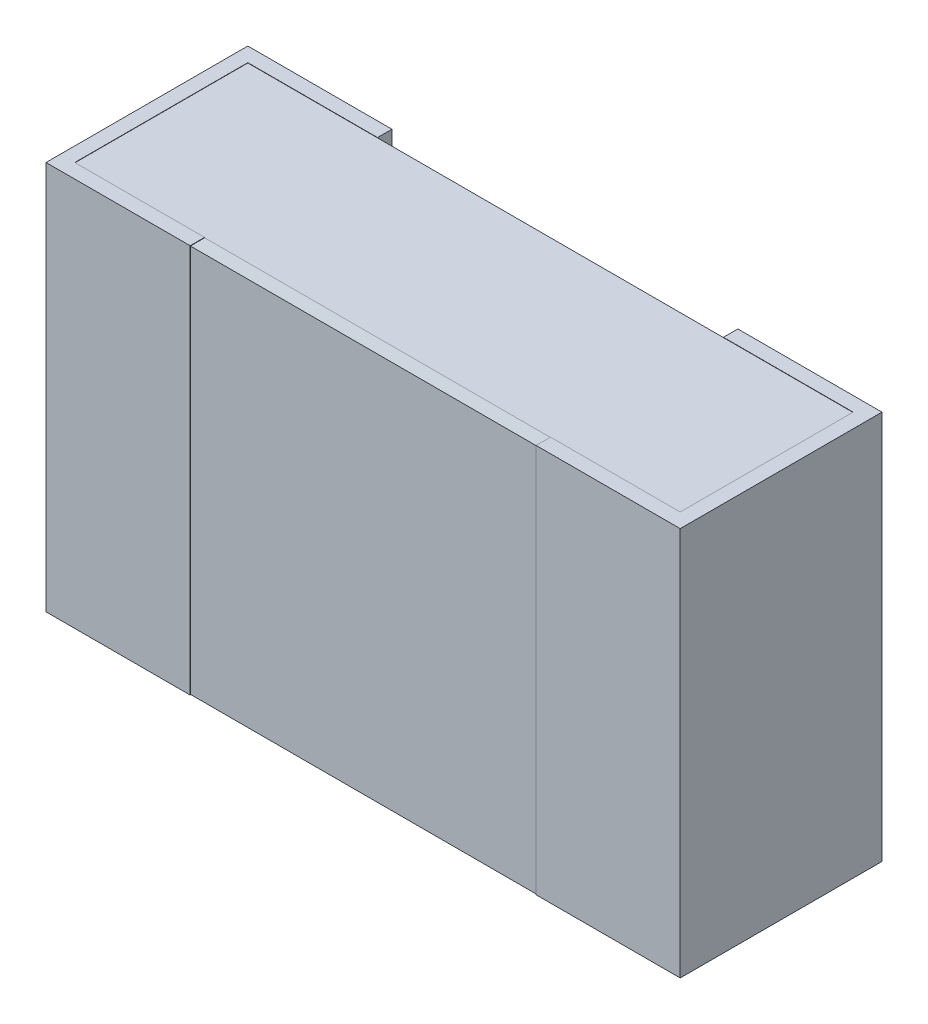
ISO-10303-21;
HEADER;
FILE_DESCRIPTION(('STEP AP214'),'2;1');
FILE_NAME('part.step','',(''),(''),'','','');
FILE_SCHEMA(('AUTOMOTIVE_DESIGN { 1 0 10303 214 1 1 1 1 }'));
ENDSEC;
DATA;
#1=APPLICATION_CONTEXT('core data for automotive mechanical design processes');
#2=APPLICATION_PROTOCOL_DEFINITION('international standard','automotive_design',2000,#1);
#3=PRODUCT_CONTEXT('',#1,'mechanical');
#4=PRODUCT('Part','Part','',(#3));
#5=PRODUCT_RELATED_PRODUCT_CATEGORY('part','',(#4));
#6=PRODUCT_DEFINITION_FORMATION('','',#4);
#7=PRODUCT_DEFINITION_CONTEXT('part definition',#1,'design');
#8=PRODUCT_DEFINITION('design','',#6,#7);
#9=PRODUCT_DEFINITION_SHAPE('','',#8);
#10=(LENGTH_UNIT() NAMED_UNIT(*) SI_UNIT(.MILLI.,.METRE.));
#11=(NAMED_UNIT(*) PLANE_ANGLE_UNIT() SI_UNIT($,.RADIAN.));
#12=(NAMED_UNIT(*) SI_UNIT($,.STERADIAN.) SOLID_ANGLE_UNIT());
#13=UNCERTAINTY_MEASURE_WITH_UNIT(LENGTH_MEASURE(1.E-05),#10,'distance_accuracy_value','');
#14=(GEOMETRIC_REPRESENTATION_CONTEXT(3) GLOBAL_UNCERTAINTY_ASSIGNED_CONTEXT((#13)) GLOBAL_UNIT_ASSIGNED_CONTEXT((#10,
#11,#12)) REPRESENTATION_CONTEXT('',''));
#15=CARTESIAN_POINT('',(0.,0.,0.));
#16=DIRECTION('',(0.,0.,1.));
#17=DIRECTION('',(1.,0.,0.));
#18=AXIS2_PLACEMENT_3D('',#15,#16,#17);
#19=CARTESIAN_POINT('',(-400000.,0.675,0.699999999995));
#20=DIRECTION('',(0.,0.,-1.));
#21=DIRECTION('',(-1.,0.,0.));
#22=AXIS2_PLACEMENT_3D('',#19,#20,#21);
#23=PLANE('',#22);
#24=DIRECTION('',(0.,1.,0.));
#25=VECTOR('',#24,1.);
#26=CARTESIAN_POINT('',(1.100000000008,0.675,0.699999999994816));
#27=LINE('',#26,#25);
#28=CARTESIAN_POINT('',(1.10000000000805,-0.675,0.699999999994954));
#29=VERTEX_POINT('',#28);
#30=CARTESIAN_POINT('',(1.10000000000803,0.675,0.699999999994908));
#31=VERTEX_POINT('',#30);
#32=EDGE_CURVE('E217',#29,#31,#27,.T.);
#33=ORIENTED_EDGE('',*,*,#32,.T.);
#34=DIRECTION('',(-1.,0.,0.));
#35=VECTOR('',#34,1.);
#36=CARTESIAN_POINT('',(-400000.,0.675,0.699999999995));
#37=LINE('',#36,#35);
#38=CARTESIAN_POINT('',(0.600000000019973,0.675,0.699999999994877));
#39=VERTEX_POINT('',#38);
#40=EDGE_CURVE('E156',#39,#31,#37,.F.);
#41=ORIENTED_EDGE('',*,*,#40,.F.);
#42=DIRECTION('',(0.,1.,0.));
#43=VECTOR('',#42,1.);
#44=CARTESIAN_POINT('',(0.60000000002,0.675,0.699999999994816));
#45=LINE('',#44,#43);
#46=CARTESIAN_POINT('',(0.600000000019973,-0.675,0.699999999994877));
#47=VERTEX_POINT('',#46);
#48=EDGE_CURVE('E243',#39,#47,#45,.F.);
#49=ORIENTED_EDGE('',*,*,#48,.T.);
#50=DIRECTION('',(-1.,0.,0.));
#51=VECTOR('',#50,1.);
#52=CARTESIAN_POINT('',(-400000.,-0.675,0.699999999995));
#53=LINE('',#52,#51);
#54=EDGE_CURVE('E163',#29,#47,#53,.T.);
#55=ORIENTED_EDGE('',*,*,#54,.F.);
#56=EDGE_LOOP('',(#33,#41,#49,#55));
#57=FACE_BOUND('',#56,.T.);
#58=ADVANCED_FACE('F17',(#57),#23,.F.);
#59=CARTESIAN_POINT('',(0.60000000002,0.675,291599.975));
#60=DIRECTION('',(1.,0.,0.));
#61=DIRECTION('',(0.,0.,-1.));
#62=AXIS2_PLACEMENT_3D('',#59,#60,#61);
#63=PLANE('',#62);
#64=DIRECTION('',(0.,1.,0.));
#65=VECTOR('',#64,1.);
#66=CARTESIAN_POINT('',(0.600000000019918,0.673,0.698999999997));
#67=LINE('',#66,#65);
#68=CARTESIAN_POINT('',(0.60000000001999,0.67351000000005,0.698999999997171));
#69=VERTEX_POINT('',#68);
#70=CARTESIAN_POINT('',(0.600000000019945,-0.673510000000042,0.698999999997114));
#71=VERTEX_POINT('',#70);
#72=EDGE_CURVE('E201',#69,#71,#67,.F.);
#73=ORIENTED_EDGE('',*,*,#72,.T.);
#74=DIRECTION('',(0.,0.00999950003953646,0.999950003749667));
#75=VECTOR('',#74,1.);
#76=CARTESIAN_POINT('',(0.60000000002,-0.674,0.650000000007367));
#77=LINE('',#76,#75);
#78=CARTESIAN_POINT('',(0.600000000019959,-0.674000000000001,0.650000000007));
#79=VERTEX_POINT('',#78);
#80=EDGE_CURVE('E207',#79,#71,#77,.T.);
#81=ORIENTED_EDGE('',*,*,#80,.F.);
#82=DIRECTION('',(0.,1.,0.));
#83=VECTOR('',#82,1.);
#84=CARTESIAN_POINT('',(0.600000000019918,0.675,0.650000000007));
#85=LINE('',#84,#83);
#86=CARTESIAN_POINT('',(0.600000000019959,-0.675,0.650000000007092));
#87=VERTEX_POINT('',#86);
#88=EDGE_CURVE('E298',#87,#79,#85,.T.);
#89=ORIENTED_EDGE('',*,*,#88,.F.);
#90=DIRECTION('',(0.,0.,-1.));
#91=VECTOR('',#90,1.);
#92=CARTESIAN_POINT('',(0.60000000002,-0.675,291599.975));
#93=LINE('',#92,#91);
#94=EDGE_CURVE('E245',#47,#87,#93,.T.);
#95=ORIENTED_EDGE('',*,*,#94,.F.);
#96=ORIENTED_EDGE('',*,*,#48,.F.);
#97=DIRECTION('',(0.,0.,-1.));
#98=VECTOR('',#97,1.);
#99=CARTESIAN_POINT('',(0.60000000002,0.675,291599.975));
#100=LINE('',#99,#98);
#101=CARTESIAN_POINT('',(0.600000000019938,0.675,0.650000000007092));
#102=VERTEX_POINT('',#101);
#103=EDGE_CURVE('E149',#102,#39,#100,.F.);
#104=ORIENTED_EDGE('',*,*,#103,.F.);
#105=DIRECTION('',(0.,1.,0.));
#106=VECTOR('',#105,1.);
#107=CARTESIAN_POINT('',(0.600000000019918,0.675,0.650000000007));
#108=LINE('',#107,#106);
#109=CARTESIAN_POINT('',(0.600000000019959,0.674000000000001,0.650000000007));
#110=VERTEX_POINT('',#109);
#111=EDGE_CURVE('E20',#110,#102,#108,.T.);
#112=ORIENTED_EDGE('',*,*,#111,.F.);
#113=DIRECTION('',(0.,0.00999950003954089,-0.999950003749667));
#114=VECTOR('',#113,1.);
#115=CARTESIAN_POINT('',(0.60000000002,0.67351,0.698999999997341));
#116=LINE('',#115,#114);
#117=EDGE_CURVE('E198',#69,#110,#116,.T.);
#118=ORIENTED_EDGE('',*,*,#117,.F.);
#119=EDGE_LOOP('',(#73,#81,#89,#95,#96,#104,#112,#118));
#120=FACE_BOUND('',#119,.T.);
#121=ADVANCED_FACE('F200',(#120),#63,.F.);
#122=CARTESIAN_POINT('',(-0.60000000002,0.675,291599.975));
#123=DIRECTION('',(-1.,0.,0.));
#124=DIRECTION('',(0.,0.,1.));
#125=AXIS2_PLACEMENT_3D('',#122,#123,#124);
#126=PLANE('',#125);
#127=DIRECTION('',(0.,-0.00999950003954089,0.999950003749667));
#128=VECTOR('',#127,1.);
#129=CARTESIAN_POINT('',(-0.60000000002,0.674,0.650000000007367));
#130=LINE('',#129,#128);
#131=CARTESIAN_POINT('',(-0.600000000019959,0.674000000000001,0.650000000007));
#132=VERTEX_POINT('',#131);
#133=CARTESIAN_POINT('',(-0.60000000002,0.67351,0.698999999997341));
#134=VERTEX_POINT('',#133);
#135=EDGE_CURVE('E220',#132,#134,#130,.T.);
#136=ORIENTED_EDGE('',*,*,#135,.F.);
#137=DIRECTION('',(0.,1.,0.));
#138=VECTOR('',#137,1.);
#139=CARTESIAN_POINT('',(-0.600000000019918,0.675,0.650000000007));
#140=LINE('',#139,#138);
#141=CARTESIAN_POINT('',(-0.600000000019959,0.675,0.650000000007092));
#142=VERTEX_POINT('',#141);
#143=EDGE_CURVE('E291',#142,#132,#140,.F.);
#144=ORIENTED_EDGE('',*,*,#143,.F.);
#145=DIRECTION('',(0.,0.,1.));
#146=VECTOR('',#145,1.);
#147=CARTESIAN_POINT('',(-0.60000000002,0.675,291599.975));
#148=LINE('',#147,#146);
#149=CARTESIAN_POINT('',(-0.600000000019945,0.675,0.699999999994939));
#150=VERTEX_POINT('',#149);
#151=EDGE_CURVE('E294',#150,#142,#148,.F.);
#152=ORIENTED_EDGE('',*,*,#151,.F.);
#153=DIRECTION('',(0.,1.,0.));
#154=VECTOR('',#153,1.);
#155=CARTESIAN_POINT('',(-0.600000000019918,0.675,0.699999999995));
#156=LINE('',#155,#154);
#157=CARTESIAN_POINT('',(-0.600000000019945,-0.675,0.699999999994939));
#158=VERTEX_POINT('',#157);
#159=EDGE_CURVE('E314',#150,#158,#156,.F.);
#160=ORIENTED_EDGE('',*,*,#159,.T.);
#161=DIRECTION('',(0.,0.,1.));
#162=VECTOR('',#161,1.);
#163=CARTESIAN_POINT('',(-0.60000000002,-0.675,291599.975));
#164=LINE('',#163,#162);
#165=CARTESIAN_POINT('',(-0.600000000019959,-0.675,0.650000000007092));
#166=VERTEX_POINT('',#165);
#167=EDGE_CURVE('E297',#166,#158,#164,.T.);
#168=ORIENTED_EDGE('',*,*,#167,.F.);
#169=DIRECTION('',(0.,1.,0.));
#170=VECTOR('',#169,1.);
#171=CARTESIAN_POINT('',(-0.600000000019918,0.675,0.650000000007));
#172=LINE('',#171,#170);
#173=CARTESIAN_POINT('',(-0.600000000019959,-0.674000000000001,0.650000000007));
#174=VERTEX_POINT('',#173);
#175=EDGE_CURVE('E295',#174,#166,#172,.F.);
#176=ORIENTED_EDGE('',*,*,#175,.F.);
#177=DIRECTION('',(0.,-0.00999950003953646,-0.999950003749667));
#178=VECTOR('',#177,1.);
#179=CARTESIAN_POINT('',(-0.60000000002,-0.67351,0.698999999997341));
#180=LINE('',#179,#178);
#181=CARTESIAN_POINT('',(-0.600000000019959,-0.673510000000013,0.69899999999717));
#182=VERTEX_POINT('',#181);
#183=EDGE_CURVE('E206',#182,#174,#180,.T.);
#184=ORIENTED_EDGE('',*,*,#183,.F.);
#185=DIRECTION('',(0.,1.,0.));
#186=VECTOR('',#185,1.);
#187=CARTESIAN_POINT('',(-0.600000000019918,0.673,0.698999999997));
#188=LINE('',#187,#186);
#189=EDGE_CURVE('E216',#182,#134,#188,.T.);
#190=ORIENTED_EDGE('',*,*,#189,.T.);
#191=EDGE_LOOP('',(#136,#144,#152,#160,#168,#176,#184,#190));
#192=FACE_BOUND('',#191,.T.);
#193=ADVANCED_FACE('F389',(#192),#126,.F.);
#194=CARTESIAN_POINT('',(-400000.,0.675,0.699999999995));
#195=DIRECTION('',(0.,0.,-1.));
#196=DIRECTION('',(-1.,0.,0.));
#197=AXIS2_PLACEMENT_3D('',#194,#195,#196);
#198=PLANE('',#197);
#199=ORIENTED_EDGE('',*,*,#159,.F.);
#200=DIRECTION('',(-1.,0.,0.));
#201=VECTOR('',#200,1.);
#202=CARTESIAN_POINT('',(-400000.,0.675,0.699999999995));
#203=LINE('',#202,#201);
#204=CARTESIAN_POINT('',(-1.10000000000803,0.675,0.699999999994939));
#205=VERTEX_POINT('',#204);
#206=EDGE_CURVE('E317',#205,#150,#203,.F.);
#207=ORIENTED_EDGE('',*,*,#206,.F.);
#208=DIRECTION('',(0.,1.,0.));
#209=VECTOR('',#208,1.);
#210=CARTESIAN_POINT('',(-1.100000000008,0.675,0.699999999994816));
#211=LINE('',#210,#209);
#212=CARTESIAN_POINT('',(-1.10000000000803,-0.675,0.699999999994939));
#213=VERTEX_POINT('',#212);
#214=EDGE_CURVE('E290',#205,#213,#211,.F.);
#215=ORIENTED_EDGE('',*,*,#214,.T.);
#216=DIRECTION('',(-1.,0.,0.));
#217=VECTOR('',#216,1.);
#218=CARTESIAN_POINT('',(-400000.,-0.675,0.699999999995));
#219=LINE('',#218,#217);
#220=EDGE_CURVE('E255',#158,#213,#219,.T.);
#221=ORIENTED_EDGE('',*,*,#220,.F.);
#222=EDGE_LOOP('',(#199,#207,#215,#221));
#223=FACE_BOUND('',#222,.T.);
#224=ADVANCED_FACE('F557',(#223),#198,.F.);
#225=CARTESIAN_POINT('',(1.100000000008,0.675,291599.975));
#226=DIRECTION('',(-1.,0.,0.));
#227=DIRECTION('',(0.,0.,1.));
#228=AXIS2_PLACEMENT_3D('',#225,#226,#227);
#229=PLANE('',#228);
#230=DIRECTION('',(0.,1.,0.));
#231=VECTOR('',#230,1.);
#232=CARTESIAN_POINT('',(1.10000000000809,0.675,0.));
#233=LINE('',#232,#231);
#234=CARTESIAN_POINT('',(1.10000000000803,-0.675,0.));
#235=VERTEX_POINT('',#234);
#236=CARTESIAN_POINT('',(1.10000000000803,0.675,0.));
#237=VERTEX_POINT('',#236);
#238=EDGE_CURVE('E179',#235,#237,#233,.T.);
#239=ORIENTED_EDGE('',*,*,#238,.T.);
#240=DIRECTION('',(0.,0.,-1.));
#241=VECTOR('',#240,1.);
#242=CARTESIAN_POINT('',(1.100000000008,0.675,0.04999999998745));
#243=LINE('',#242,#241);
#244=EDGE_CURVE('E286',#237,#31,#243,.F.);
#245=ORIENTED_EDGE('',*,*,#244,.T.);
#246=ORIENTED_EDGE('',*,*,#32,.F.);
#247=DIRECTION('',(0.,0.,-1.));
#248=VECTOR('',#247,1.);
#249=CARTESIAN_POINT('',(1.100000000008,-0.675,0.04999999998745));
#250=LINE('',#249,#248);
#251=EDGE_CURVE('E347',#235,#29,#250,.F.);
#252=ORIENTED_EDGE('',*,*,#251,.F.);
#253=EDGE_LOOP('',(#239,#245,#246,#252));
#254=FACE_BOUND('',#253,.T.);
#255=ADVANCED_FACE('F568',(#254),#229,.F.);
#256=CARTESIAN_POINT('',(-400000.,0.673,0.698999999997));
#257=DIRECTION('',(0.,0.,-1.));
#258=DIRECTION('',(-1.,0.,0.));
#259=AXIS2_PLACEMENT_3D('',#256,#257,#258);
#260=PLANE('',#259);
#261=DIRECTION('',(1.,0.,0.));
#262=VECTOR('',#261,1.);
#263=CARTESIAN_POINT('',(-400000.,-0.6735100000001,0.698999999997001));
#264=LINE('',#263,#262);
#265=EDGE_CURVE('E215',#71,#182,#264,.F.);
#266=ORIENTED_EDGE('',*,*,#265,.F.);
#267=ORIENTED_EDGE('',*,*,#72,.F.);
#268=DIRECTION('',(1.,0.,0.));
#269=VECTOR('',#268,1.);
#270=CARTESIAN_POINT('',(-0.60000000002,0.6735100000001,0.698999999997001));
#271=LINE('',#270,#269);
#272=EDGE_CURVE('E213',#69,#134,#271,.F.);
#273=ORIENTED_EDGE('',*,*,#272,.T.);
#274=ORIENTED_EDGE('',*,*,#189,.F.);
#275=EDGE_LOOP('',(#266,#267,#273,#274));
#276=FACE_BOUND('',#275,.T.);
#277=ADVANCED_FACE('F211',(#276),#260,.F.);
#278=CARTESIAN_POINT('',(-1.100000000008,0.675,291599.975));
#279=DIRECTION('',(1.,0.,0.));
#280=DIRECTION('',(0.,0.,-1.));
#281=AXIS2_PLACEMENT_3D('',#278,#279,#280);
#282=PLANE('',#281);
#283=ORIENTED_EDGE('',*,*,#214,.F.);
#284=DIRECTION('',(0.,0.,-1.));
#285=VECTOR('',#284,1.);
#286=CARTESIAN_POINT('',(-1.100000000008,0.675,0.650000000007));
#287=LINE('',#286,#285);
#288=CARTESIAN_POINT('',(-1.10000000000806,0.675,0.));
#289=VERTEX_POINT('',#288);
#290=EDGE_CURVE('E274',#205,#289,#287,.T.);
#291=ORIENTED_EDGE('',*,*,#290,.T.);
#292=DIRECTION('',(0.,1.,0.));
#293=VECTOR('',#292,1.);
#294=CARTESIAN_POINT('',(-1.10000000000809,0.675,0.));
#295=LINE('',#294,#293);
#296=CARTESIAN_POINT('',(-1.10000000000803,-0.675,0.));
#297=VERTEX_POINT('',#296);
#298=EDGE_CURVE('E419',#289,#297,#295,.F.);
#299=ORIENTED_EDGE('',*,*,#298,.T.);
#300=DIRECTION('',(0.,0.,-1.));
#301=VECTOR('',#300,1.);
#302=CARTESIAN_POINT('',(-1.100000000008,-0.675,0.650000000007));
#303=LINE('',#302,#301);
#304=EDGE_CURVE('E418',#213,#297,#303,.T.);
#305=ORIENTED_EDGE('',*,*,#304,.F.);
#306=EDGE_LOOP('',(#283,#291,#299,#305));
#307=FACE_BOUND('',#306,.T.);
#308=ADVANCED_FACE('F559',(#307),#282,.F.);
#309=CARTESIAN_POINT('',(-1.050000000021,0.675,291599.975));
#310=DIRECTION('',(-1.,0.,0.));
#311=DIRECTION('',(0.,0.,1.));
#312=AXIS2_PLACEMENT_3D('',#309,#310,#311);
#313=PLANE('',#312);
#314=DIRECTION('',(0.,0.,1.));
#315=VECTOR('',#314,1.);
#316=CARTESIAN_POINT('',(-1.050000000021,-0.674,0.04999999998745));
#317=LINE('',#316,#315);
#318=CARTESIAN_POINT('',(-1.050000000021,-0.674,0.0499999999874495));
#319=VERTEX_POINT('',#318);
#320=CARTESIAN_POINT('',(-1.050000000021,-0.674,0.650000000007183));
#321=VERTEX_POINT('',#320);
#322=EDGE_CURVE('E400',#319,#321,#317,.T.);
#323=ORIENTED_EDGE('',*,*,#322,.T.);
#324=DIRECTION('',(0.,1.,0.));
#325=VECTOR('',#324,1.);
#326=CARTESIAN_POINT('',(-1.050000000021,0.675,0.650000000007367));
#327=LINE('',#326,#325);
#328=CARTESIAN_POINT('',(-1.050000000021,-0.675,0.650000000007183));
#329=VERTEX_POINT('',#328);
#330=EDGE_CURVE('E238',#321,#329,#327,.F.);
#331=ORIENTED_EDGE('',*,*,#330,.T.);
#332=DIRECTION('',(0.,0.,-1.));
#333=VECTOR('',#332,1.);
#334=CARTESIAN_POINT('',(-1.050000000021,-0.675,0.650000000007));
#335=LINE('',#334,#333);
#336=CARTESIAN_POINT('',(-1.050000000021,-0.675,0.0499999999874495));
#337=VERTEX_POINT('',#336);
#338=EDGE_CURVE('E412',#337,#329,#335,.F.);
#339=ORIENTED_EDGE('',*,*,#338,.F.);
#340=DIRECTION('',(0.,1.,0.));
#341=VECTOR('',#340,1.);
#342=CARTESIAN_POINT('',(-1.050000000021,0.675,0.049999999987449));
#343=LINE('',#342,#341);
#344=EDGE_CURVE('E275',#337,#319,#343,.T.);
#345=ORIENTED_EDGE('',*,*,#344,.T.);
#346=EDGE_LOOP('',(#323,#331,#339,#345));
#347=FACE_BOUND('',#346,.T.);
#348=ADVANCED_FACE('F555',(#347),#313,.F.);
#349=CARTESIAN_POINT('',(-400000.,0.675,0.650000000007));
#350=DIRECTION('',(0.,0.,1.));
#351=DIRECTION('',(1.,0.,0.));
#352=AXIS2_PLACEMENT_3D('',#349,#350,#351);
#353=PLANE('',#352);
#354=DIRECTION('',(1.,0.,0.));
#355=VECTOR('',#354,1.);
#356=CARTESIAN_POINT('',(-1.050000000021,-0.674,0.650000000007));
#357=LINE('',#356,#355);
#358=EDGE_CURVE('E395',#321,#174,#357,.T.);
#359=ORIENTED_EDGE('',*,*,#358,.T.);
#360=ORIENTED_EDGE('',*,*,#175,.T.);
#361=DIRECTION('',(1.,0.,0.));
#362=VECTOR('',#361,1.);
#363=CARTESIAN_POINT('',(-1.050000000021,-0.675,0.650000000007));
#364=LINE('',#363,#362);
#365=EDGE_CURVE('E416',#329,#166,#364,.T.);
#366=ORIENTED_EDGE('',*,*,#365,.F.);
#367=ORIENTED_EDGE('',*,*,#330,.F.);
#368=EDGE_LOOP('',(#359,#360,#366,#367));
#369=FACE_BOUND('',#368,.T.);
#370=ADVANCED_FACE('F396',(#369),#353,.F.);
#371=CARTESIAN_POINT('',(-400000.,-0.674,0.650000000007));
#372=DIRECTION('',(0.,-0.999950003749688,0.00999950003749388));
#373=DIRECTION('',(0.,-0.00999950003749388,-0.999950003749688));
#374=AXIS2_PLACEMENT_3D('',#371,#372,#373);
#375=PLANE('',#374);
#376=ORIENTED_EDGE('',*,*,#183,.T.);
#377=DIRECTION('',(1.,0.,0.));
#378=VECTOR('',#377,1.);
#379=CARTESIAN_POINT('',(-1.050000000021,-0.674,0.650000000007));
#380=LINE('',#379,#378);
#381=EDGE_CURVE('E387',#174,#79,#380,.T.);
#382=ORIENTED_EDGE('',*,*,#381,.T.);
#383=ORIENTED_EDGE('',*,*,#80,.T.);
#384=ORIENTED_EDGE('',*,*,#265,.T.);
#385=EDGE_LOOP('',(#376,#382,#383,#384));
#386=FACE_BOUND('',#385,.T.);
#387=ADVANCED_FACE('F385',(#386),#375,.T.);
#388=CARTESIAN_POINT('',(-400000.,0.675,0.650000000007));
#389=DIRECTION('',(0.,0.,1.));
#390=DIRECTION('',(1.,0.,0.));
#391=AXIS2_PLACEMENT_3D('',#388,#389,#390);
#392=PLANE('',#391);
#393=DIRECTION('',(1.,0.,0.));
#394=VECTOR('',#393,1.);
#395=CARTESIAN_POINT('',(-1.050000000021,-0.674,0.650000000007));
#396=LINE('',#395,#394);
#397=CARTESIAN_POINT('',(1.05000000002082,-0.674,0.650000000007));
#398=VERTEX_POINT('',#397);
#399=EDGE_CURVE('E404',#79,#398,#396,.T.);
#400=ORIENTED_EDGE('',*,*,#399,.T.);
#401=DIRECTION('',(0.,1.,0.));
#402=VECTOR('',#401,1.);
#403=CARTESIAN_POINT('',(1.05000000002065,0.675,0.650000000007));
#404=LINE('',#403,#402);
#405=CARTESIAN_POINT('',(1.05000000002082,-0.675,0.650000000007));
#406=VERTEX_POINT('',#405);
#407=EDGE_CURVE('E237',#398,#406,#404,.F.);
#408=ORIENTED_EDGE('',*,*,#407,.T.);
#409=DIRECTION('',(1.,0.,0.));
#410=VECTOR('',#409,1.);
#411=CARTESIAN_POINT('',(1.050000000021,-0.675,0.650000000007));
#412=LINE('',#411,#410);
#413=EDGE_CURVE('E344',#87,#406,#412,.T.);
#414=ORIENTED_EDGE('',*,*,#413,.F.);
#415=ORIENTED_EDGE('',*,*,#88,.T.);
#416=EDGE_LOOP('',(#400,#408,#414,#415));
#417=FACE_BOUND('',#416,.T.);
#418=ADVANCED_FACE('F630',(#417),#392,.F.);
#419=CARTESIAN_POINT('',(1.050000000021,0.675,291599.975));
#420=DIRECTION('',(1.,0.,0.));
#421=DIRECTION('',(0.,0.,-1.));
#422=AXIS2_PLACEMENT_3D('',#419,#420,#421);
#423=PLANE('',#422);
#424=DIRECTION('',(0.,0.,1.));
#425=VECTOR('',#424,1.);
#426=CARTESIAN_POINT('',(1.050000000021,-0.674,0.04999999998745));
#427=LINE('',#426,#425);
#428=CARTESIAN_POINT('',(1.050000000021,-0.674,0.0499999999874495));
#429=VERTEX_POINT('',#428);
#430=EDGE_CURVE('E406',#398,#429,#427,.F.);
#431=ORIENTED_EDGE('',*,*,#430,.T.);
#432=DIRECTION('',(0.,1.,0.));
#433=VECTOR('',#432,1.);
#434=CARTESIAN_POINT('',(1.050000000021,0.675,0.049999999987449));
#435=LINE('',#434,#433);
#436=CARTESIAN_POINT('',(1.050000000021,-0.675,0.0499999999874495));
#437=VERTEX_POINT('',#436);
#438=EDGE_CURVE('E283',#429,#437,#435,.F.);
#439=ORIENTED_EDGE('',*,*,#438,.T.);
#440=DIRECTION('',(0.,0.,-1.));
#441=VECTOR('',#440,1.);
#442=CARTESIAN_POINT('',(1.050000000021,-0.675,0.04999999998745));
#443=LINE('',#442,#441);
#444=EDGE_CURVE('E346',#406,#437,#443,.T.);
#445=ORIENTED_EDGE('',*,*,#444,.F.);
#446=ORIENTED_EDGE('',*,*,#407,.F.);
#447=EDGE_LOOP('',(#431,#439,#445,#446));
#448=FACE_BOUND('',#447,.T.);
#449=ADVANCED_FACE('F627',(#448),#423,.F.);
#450=CARTESIAN_POINT('',(-400000.,0.675,0.));
#451=DIRECTION('',(0.,0.,1.));
#452=DIRECTION('',(1.,0.,0.));
#453=AXIS2_PLACEMENT_3D('',#450,#451,#452);
#454=PLANE('',#453);
#455=DIRECTION('',(0.,1.,0.));
#456=VECTOR('',#455,1.);
#457=CARTESIAN_POINT('',(0.60000000002,0.675,0.));
#458=LINE('',#457,#456);
#459=CARTESIAN_POINT('',(0.60000000002,-0.675,0.));
#460=VERTEX_POINT('',#459);
#461=CARTESIAN_POINT('',(0.60000000002,0.675,0.));
#462=VERTEX_POINT('',#461);
#463=EDGE_CURVE('E470',#460,#462,#458,.T.);
#464=ORIENTED_EDGE('',*,*,#463,.T.);
#465=DIRECTION('',(1.,0.,0.));
#466=VECTOR('',#465,1.);
#467=CARTESIAN_POINT('',(1.050000000021,0.675,0.));
#468=LINE('',#467,#466);
#469=EDGE_CURVE('E351',#462,#237,#468,.T.);
#470=ORIENTED_EDGE('',*,*,#469,.T.);
#471=ORIENTED_EDGE('',*,*,#238,.F.);
#472=DIRECTION('',(1.,0.,0.));
#473=VECTOR('',#472,1.);
#474=CARTESIAN_POINT('',(1.050000000021,-0.675,0.));
#475=LINE('',#474,#473);
#476=EDGE_CURVE('E355',#460,#235,#475,.T.);
#477=ORIENTED_EDGE('',*,*,#476,.F.);
#478=EDGE_LOOP('',(#464,#470,#471,#477));
#479=FACE_BOUND('',#478,.T.);
#480=ADVANCED_FACE('F542',(#479),#454,.F.);
#481=CARTESIAN_POINT('',(1.050000000021,0.675,0.04999999998745));
#482=DIRECTION('',(0.,-1.,0.));
#483=DIRECTION('',(0.,0.,-1.));
#484=AXIS2_PLACEMENT_3D('',#481,#482,#483);
#485=PLANE('',#484);
#486=DIRECTION('',(0.,0.,-1.));
#487=VECTOR('',#486,1.);
#488=CARTESIAN_POINT('',(1.050000000021,0.675,291599.975));
#489=LINE('',#488,#487);
#490=CARTESIAN_POINT('',(1.05000000002073,0.675,0.0499999999939396));
#491=VERTEX_POINT('',#490);
#492=CARTESIAN_POINT('',(1.05000000002073,0.675,0.650000000007092));
#493=VERTEX_POINT('',#492);
#494=EDGE_CURVE('E280',#491,#493,#489,.F.);
#495=ORIENTED_EDGE('',*,*,#494,.T.);
#496=DIRECTION('',(1.,0.,0.));
#497=VECTOR('',#496,1.);
#498=CARTESIAN_POINT('',(-400000.,0.675,0.650000000007));
#499=LINE('',#498,#497);
#500=EDGE_CURVE('E222',#493,#102,#499,.F.);
#501=ORIENTED_EDGE('',*,*,#500,.T.);
#502=ORIENTED_EDGE('',*,*,#103,.T.);
#503=ORIENTED_EDGE('',*,*,#40,.T.);
#504=ORIENTED_EDGE('',*,*,#244,.F.);
#505=ORIENTED_EDGE('',*,*,#469,.F.);
#506=DIRECTION('',(0.,0.,-1.));
#507=VECTOR('',#506,1.);
#508=CARTESIAN_POINT('',(0.60000000002,0.675,291599.975));
#509=LINE('',#508,#507);
#510=CARTESIAN_POINT('',(0.600000000019938,0.675,0.0499999999939396));
#511=VERTEX_POINT('',#510);
#512=EDGE_CURVE('E271',#462,#511,#509,.F.);
#513=ORIENTED_EDGE('',*,*,#512,.T.);
#514=DIRECTION('',(-1.,0.,0.));
#515=VECTOR('',#514,1.);
#516=CARTESIAN_POINT('',(-400000.,0.675,0.05000000004429));
#517=LINE('',#516,#515);
#518=EDGE_CURVE('E228',#511,#491,#517,.F.);
#519=ORIENTED_EDGE('',*,*,#518,.T.);
#520=EDGE_LOOP('',(#495,#501,#502,#503,#504,#505,#513,#519));
#521=FACE_BOUND('',#520,.T.);
#522=ADVANCED_FACE('F538',(#521),#485,.F.);
#523=CARTESIAN_POINT('',(-400000.,0.675,0.05000000004429));
#524=DIRECTION('',(0.,0.,-1.));
#525=DIRECTION('',(-1.,0.,0.));
#526=AXIS2_PLACEMENT_3D('',#523,#524,#525);
#527=PLANE('',#526);
#528=DIRECTION('',(1.,0.,0.));
#529=VECTOR('',#528,1.);
#530=CARTESIAN_POINT('',(-1.050000000021,-0.674,0.04999999998745));
#531=LINE('',#530,#529);
#532=CARTESIAN_POINT('',(0.600000000019959,-0.674,0.0499999999917766));
#533=VERTEX_POINT('',#532);
#534=EDGE_CURVE('E473',#429,#533,#531,.F.);
#535=ORIENTED_EDGE('',*,*,#534,.T.);
#536=DIRECTION('',(0.,1.,0.));
#537=VECTOR('',#536,1.);
#538=CARTESIAN_POINT('',(0.600000000019918,0.675,0.0499999999961032));
#539=LINE('',#538,#537);
#540=CARTESIAN_POINT('',(0.600000000019959,-0.675,0.049999999989613));
#541=VERTEX_POINT('',#540);
#542=EDGE_CURVE('E264',#533,#541,#539,.F.);
#543=ORIENTED_EDGE('',*,*,#542,.T.);
#544=DIRECTION('',(1.,0.,0.));
#545=VECTOR('',#544,1.);
#546=CARTESIAN_POINT('',(1.050000000021,-0.675,0.04999999998745));
#547=LINE('',#546,#545);
#548=EDGE_CURVE('E285',#437,#541,#547,.F.);
#549=ORIENTED_EDGE('',*,*,#548,.F.);
#550=ORIENTED_EDGE('',*,*,#438,.F.);
#551=EDGE_LOOP('',(#535,#543,#549,#550));
#552=FACE_BOUND('',#551,.T.);
#553=ADVANCED_FACE('F545',(#552),#527,.F.);
#554=CARTESIAN_POINT('',(1.050000000021,-0.675,0.04999999998745));
#555=DIRECTION('',(0.,-1.,0.));
#556=DIRECTION('',(0.,0.,-1.));
#557=AXIS2_PLACEMENT_3D('',#554,#555,#556);
#558=PLANE('',#557);
#559=ORIENTED_EDGE('',*,*,#413,.T.);
#560=ORIENTED_EDGE('',*,*,#444,.T.);
#561=ORIENTED_EDGE('',*,*,#548,.T.);
#562=DIRECTION('',(0.,0.,-1.));
#563=VECTOR('',#562,1.);
#564=CARTESIAN_POINT('',(0.60000000002,-0.675,291599.975));
#565=LINE('',#564,#563);
#566=EDGE_CURVE('E267',#541,#460,#565,.T.);
#567=ORIENTED_EDGE('',*,*,#566,.T.);
#568=ORIENTED_EDGE('',*,*,#476,.T.);
#569=ORIENTED_EDGE('',*,*,#251,.T.);
#570=ORIENTED_EDGE('',*,*,#54,.T.);
#571=ORIENTED_EDGE('',*,*,#94,.T.);
#572=EDGE_LOOP('',(#559,#560,#561,#567,#568,#569,#570,#571));
#573=FACE_BOUND('',#572,.T.);
#574=ADVANCED_FACE('F543',(#573),#558,.T.);
#575=CARTESIAN_POINT('',(-400000.,0.675,0.05000000004429));
#576=DIRECTION('',(0.,0.,-1.));
#577=DIRECTION('',(-1.,0.,0.));
#578=AXIS2_PLACEMENT_3D('',#575,#576,#577);
#579=PLANE('',#578);
#580=DIRECTION('',(0.,1.,0.));
#581=VECTOR('',#580,1.);
#582=CARTESIAN_POINT('',(1.05000000002065,0.675,0.0499999999961031));
#583=LINE('',#582,#581);
#584=CARTESIAN_POINT('',(1.05000000002091,0.674,0.0499999999917766));
#585=VERTEX_POINT('',#584);
#586=EDGE_CURVE('E225',#585,#491,#583,.T.);
#587=ORIENTED_EDGE('',*,*,#586,.T.);
#588=ORIENTED_EDGE('',*,*,#518,.F.);
#589=DIRECTION('',(0.,1.,0.));
#590=VECTOR('',#589,1.);
#591=CARTESIAN_POINT('',(0.600000000019918,0.675,0.0499999999961032));
#592=LINE('',#591,#590);
#593=CARTESIAN_POINT('',(0.600000000019918,0.674,0.0499999999917766));
#594=VERTEX_POINT('',#593);
#595=EDGE_CURVE('E268',#511,#594,#592,.F.);
#596=ORIENTED_EDGE('',*,*,#595,.T.);
#597=DIRECTION('',(1.,0.,0.));
#598=VECTOR('',#597,1.);
#599=CARTESIAN_POINT('',(-1.050000000021,0.674,0.04999999998745));
#600=LINE('',#599,#598);
#601=EDGE_CURVE('E496',#585,#594,#600,.F.);
#602=ORIENTED_EDGE('',*,*,#601,.F.);
#603=EDGE_LOOP('',(#587,#588,#596,#602));
#604=FACE_BOUND('',#603,.T.);
#605=ADVANCED_FACE('F614',(#604),#579,.F.);
#606=CARTESIAN_POINT('',(-1.050000000021,0.675,291599.975));
#607=DIRECTION('',(-1.,0.,0.));
#608=DIRECTION('',(0.,0.,1.));
#609=AXIS2_PLACEMENT_3D('',#606,#607,#608);
#610=PLANE('',#609);
#611=DIRECTION('',(0.,1.,0.));
#612=VECTOR('',#611,1.);
#613=CARTESIAN_POINT('',(-1.050000000021,0.675,0.049999999987449));
#614=LINE('',#613,#612);
#615=CARTESIAN_POINT('',(-1.050000000021,0.674,0.0499999999874495));
#616=VERTEX_POINT('',#615);
#617=CARTESIAN_POINT('',(-1.050000000021,0.675,0.0499999999874495));
#618=VERTEX_POINT('',#617);
#619=EDGE_CURVE('E272',#616,#618,#614,.T.);
#620=ORIENTED_EDGE('',*,*,#619,.T.);
#621=DIRECTION('',(0.,0.,-1.));
#622=VECTOR('',#621,1.);
#623=CARTESIAN_POINT('',(-1.050000000021,0.675,0.650000000007));
#624=LINE('',#623,#622);
#625=CARTESIAN_POINT('',(-1.050000000021,0.675,0.650000000007183));
#626=VERTEX_POINT('',#625);
#627=EDGE_CURVE('E337',#618,#626,#624,.F.);
#628=ORIENTED_EDGE('',*,*,#627,.T.);
#629=DIRECTION('',(0.,1.,0.));
#630=VECTOR('',#629,1.);
#631=CARTESIAN_POINT('',(-1.050000000021,0.675,0.650000000007367));
#632=LINE('',#631,#630);
#633=CARTESIAN_POINT('',(-1.050000000021,0.674,0.650000000007183));
#634=VERTEX_POINT('',#633);
#635=EDGE_CURVE('E223',#626,#634,#632,.F.);
#636=ORIENTED_EDGE('',*,*,#635,.T.);
#637=DIRECTION('',(0.,0.,1.));
#638=VECTOR('',#637,1.);
#639=CARTESIAN_POINT('',(-1.050000000021,0.674,0.04999999998745));
#640=LINE('',#639,#638);
#641=EDGE_CURVE('E461',#616,#634,#640,.T.);
#642=ORIENTED_EDGE('',*,*,#641,.F.);
#643=EDGE_LOOP('',(#620,#628,#636,#642));
#644=FACE_BOUND('',#643,.T.);
#645=ADVANCED_FACE('F610',(#644),#610,.F.);
#646=CARTESIAN_POINT('',(-400000.,0.675,0.650000000007));
#647=DIRECTION('',(0.,0.,1.));
#648=DIRECTION('',(1.,0.,0.));
#649=AXIS2_PLACEMENT_3D('',#646,#647,#648);
#650=PLANE('',#649);
#651=ORIENTED_EDGE('',*,*,#635,.F.);
#652=DIRECTION('',(1.,0.,0.));
#653=VECTOR('',#652,1.);
#654=CARTESIAN_POINT('',(-1.050000000021,0.675,0.650000000007));
#655=LINE('',#654,#653);
#656=EDGE_CURVE('E340',#626,#142,#655,.T.);
#657=ORIENTED_EDGE('',*,*,#656,.T.);
#658=ORIENTED_EDGE('',*,*,#143,.T.);
#659=DIRECTION('',(1.,0.,0.));
#660=VECTOR('',#659,1.);
#661=CARTESIAN_POINT('',(-1.050000000021,0.674,0.650000000007));
#662=LINE('',#661,#660);
#663=EDGE_CURVE('E458',#634,#132,#662,.T.);
#664=ORIENTED_EDGE('',*,*,#663,.F.);
#665=EDGE_LOOP('',(#651,#657,#658,#664));
#666=FACE_BOUND('',#665,.T.);
#667=ADVANCED_FACE('F607',(#666),#650,.F.);
#668=CARTESIAN_POINT('',(-0.60000000002,0.673,0.750000000007));
#669=DIRECTION('',(0.,-0.999950003749688,-0.00999950003749388));
#670=DIRECTION('',(0.,0.00999950003749388,-0.999950003749688));
#671=AXIS2_PLACEMENT_3D('',#668,#669,#670);
#672=PLANE('',#671);
#673=DIRECTION('',(1.,0.,0.));
#674=VECTOR('',#673,1.);
#675=CARTESIAN_POINT('',(-1.050000000021,0.674,0.650000000007));
#676=LINE('',#675,#674);
#677=EDGE_CURVE('E453',#132,#110,#676,.T.);
#678=ORIENTED_EDGE('',*,*,#677,.F.);
#679=ORIENTED_EDGE('',*,*,#135,.T.);
#680=ORIENTED_EDGE('',*,*,#272,.F.);
#681=ORIENTED_EDGE('',*,*,#117,.T.);
#682=EDGE_LOOP('',(#678,#679,#680,#681));
#683=FACE_BOUND('',#682,.T.);
#684=ADVANCED_FACE('F219',(#683),#672,.F.);
#685=CARTESIAN_POINT('',(-400000.,0.675,0.650000000007));
#686=DIRECTION('',(0.,0.,1.));
#687=DIRECTION('',(1.,0.,0.));
#688=AXIS2_PLACEMENT_3D('',#685,#686,#687);
#689=PLANE('',#688);
#690=ORIENTED_EDGE('',*,*,#111,.T.);
#691=ORIENTED_EDGE('',*,*,#500,.F.);
#692=DIRECTION('',(0.,1.,0.));
#693=VECTOR('',#692,1.);
#694=CARTESIAN_POINT('',(1.05000000002065,0.675,0.650000000007));
#695=LINE('',#694,#693);
#696=CARTESIAN_POINT('',(1.05000000002082,0.674,0.650000000007));
#697=VERTEX_POINT('',#696);
#698=EDGE_CURVE('E277',#493,#697,#695,.F.);
#699=ORIENTED_EDGE('',*,*,#698,.T.);
#700=DIRECTION('',(1.,0.,0.));
#701=VECTOR('',#700,1.);
#702=CARTESIAN_POINT('',(-1.050000000021,0.674,0.650000000007));
#703=LINE('',#702,#701);
#704=EDGE_CURVE('E451',#110,#697,#703,.T.);
#705=ORIENTED_EDGE('',*,*,#704,.F.);
#706=EDGE_LOOP('',(#690,#691,#699,#705));
#707=FACE_BOUND('',#706,.T.);
#708=ADVANCED_FACE('F600',(#707),#689,.F.);
#709=CARTESIAN_POINT('',(1.050000000021,0.675,291599.975));
#710=DIRECTION('',(1.,0.,0.));
#711=DIRECTION('',(0.,0.,-1.));
#712=AXIS2_PLACEMENT_3D('',#709,#710,#711);
#713=PLANE('',#712);
#714=ORIENTED_EDGE('',*,*,#698,.F.);
#715=ORIENTED_EDGE('',*,*,#494,.F.);
#716=ORIENTED_EDGE('',*,*,#586,.F.);
#717=DIRECTION('',(0.,0.,1.));
#718=VECTOR('',#717,1.);
#719=CARTESIAN_POINT('',(1.050000000021,0.674,0.04999999998745));
#720=LINE('',#719,#718);
#721=EDGE_CURVE('E263',#697,#585,#720,.F.);
#722=ORIENTED_EDGE('',*,*,#721,.F.);
#723=EDGE_LOOP('',(#714,#715,#716,#722));
#724=FACE_BOUND('',#723,.T.);
#725=ADVANCED_FACE('F597',(#724),#713,.F.);
#726=CARTESIAN_POINT('',(-400000.,0.675,0.04999999993061));
#727=DIRECTION('',(0.,0.,-1.));
#728=DIRECTION('',(-1.,0.,0.));
#729=AXIS2_PLACEMENT_3D('',#726,#727,#728);
#730=PLANE('',#729);
#731=DIRECTION('',(1.,0.,0.));
#732=VECTOR('',#731,1.);
#733=CARTESIAN_POINT('',(-1.050000000021,-0.674,0.04999999998745));
#734=LINE('',#733,#732);
#735=CARTESIAN_POINT('',(-0.600000000019959,-0.674,0.0499999999831233));
#736=VERTEX_POINT('',#735);
#737=EDGE_CURVE('E411',#736,#319,#734,.F.);
#738=ORIENTED_EDGE('',*,*,#737,.T.);
#739=ORIENTED_EDGE('',*,*,#344,.F.);
#740=DIRECTION('',(1.,0.,0.));
#741=VECTOR('',#740,1.);
#742=CARTESIAN_POINT('',(-1.050000000021,-0.675,0.0499999999874501));
#743=LINE('',#742,#741);
#744=CARTESIAN_POINT('',(-0.600000000019959,-0.675,0.0499999999852864));
#745=VERTEX_POINT('',#744);
#746=EDGE_CURVE('E415',#745,#337,#743,.F.);
#747=ORIENTED_EDGE('',*,*,#746,.F.);
#748=DIRECTION('',(0.,1.,0.));
#749=VECTOR('',#748,1.);
#750=CARTESIAN_POINT('',(-0.600000000019918,0.675,0.0499999999787967));
#751=LINE('',#750,#749);
#752=EDGE_CURVE('E260',#745,#736,#751,.T.);
#753=ORIENTED_EDGE('',*,*,#752,.T.);
#754=EDGE_LOOP('',(#738,#739,#747,#753));
#755=FACE_BOUND('',#754,.T.);
#756=ADVANCED_FACE('F553',(#755),#730,.F.);
#757=CARTESIAN_POINT('',(-400000.,0.675,0.04999999993061));
#758=DIRECTION('',(0.,0.,-1.));
#759=DIRECTION('',(-1.,0.,0.));
#760=AXIS2_PLACEMENT_3D('',#757,#758,#759);
#761=PLANE('',#760);
#762=DIRECTION('',(0.,1.,0.));
#763=VECTOR('',#762,1.);
#764=CARTESIAN_POINT('',(-0.600000000019918,0.675,0.0499999999787967));
#765=LINE('',#764,#763);
#766=CARTESIAN_POINT('',(-0.600000000019959,0.674,0.0499999999831233));
#767=VERTEX_POINT('',#766);
#768=CARTESIAN_POINT('',(-0.600000000019959,0.675,0.0499999999852864));
#769=VERTEX_POINT('',#768);
#770=EDGE_CURVE('E34',#767,#769,#765,.T.);
#771=ORIENTED_EDGE('',*,*,#770,.T.);
#772=DIRECTION('',(1.,0.,0.));
#773=VECTOR('',#772,1.);
#774=CARTESIAN_POINT('',(-1.050000000021,0.675,0.0499999999874501));
#775=LINE('',#774,#773);
#776=EDGE_CURVE('E334',#769,#618,#775,.F.);
#777=ORIENTED_EDGE('',*,*,#776,.T.);
#778=ORIENTED_EDGE('',*,*,#619,.F.);
#779=DIRECTION('',(1.,0.,0.));
#780=VECTOR('',#779,1.);
#781=CARTESIAN_POINT('',(-1.050000000021,0.674,0.04999999998745));
#782=LINE('',#781,#780);
#783=EDGE_CURVE('E463',#767,#616,#782,.F.);
#784=ORIENTED_EDGE('',*,*,#783,.F.);
#785=EDGE_LOOP('',(#771,#777,#778,#784));
#786=FACE_BOUND('',#785,.T.);
#787=ADVANCED_FACE('F591',(#786),#761,.F.);
#788=CARTESIAN_POINT('',(-1.050000000021,0.675,0.650000000007));
#789=DIRECTION('',(0.,-1.,0.));
#790=DIRECTION('',(0.,0.,-1.));
#791=AXIS2_PLACEMENT_3D('',#788,#789,#790);
#792=PLANE('',#791);
#793=ORIENTED_EDGE('',*,*,#627,.F.);
#794=ORIENTED_EDGE('',*,*,#776,.F.);
#795=DIRECTION('',(0.,0.,1.));
#796=VECTOR('',#795,1.);
#797=CARTESIAN_POINT('',(-0.60000000002,0.675,291599.975));
#798=LINE('',#797,#796);
#799=CARTESIAN_POINT('',(-0.600000000019973,0.675,0.));
#800=VERTEX_POINT('',#799);
#801=EDGE_CURVE('E259',#769,#800,#798,.F.);
#802=ORIENTED_EDGE('',*,*,#801,.T.);
#803=DIRECTION('',(1.,0.,0.));
#804=VECTOR('',#803,1.);
#805=CARTESIAN_POINT('',(-400000.,0.675,0.));
#806=LINE('',#805,#804);
#807=EDGE_CURVE('E343',#800,#289,#806,.F.);
#808=ORIENTED_EDGE('',*,*,#807,.T.);
#809=ORIENTED_EDGE('',*,*,#290,.F.);
#810=ORIENTED_EDGE('',*,*,#206,.T.);
#811=ORIENTED_EDGE('',*,*,#151,.T.);
#812=ORIENTED_EDGE('',*,*,#656,.F.);
#813=EDGE_LOOP('',(#793,#794,#802,#808,#809,#810,#811,#812));
#814=FACE_BOUND('',#813,.T.);
#815=ADVANCED_FACE('F528',(#814),#792,.F.);
#816=CARTESIAN_POINT('',(-400000.,0.675,0.));
#817=DIRECTION('',(0.,0.,1.));
#818=DIRECTION('',(1.,0.,0.));
#819=AXIS2_PLACEMENT_3D('',#816,#817,#818);
#820=PLANE('',#819);
#821=ORIENTED_EDGE('',*,*,#298,.F.);
#822=ORIENTED_EDGE('',*,*,#807,.F.);
#823=DIRECTION('',(0.,1.,0.));
#824=VECTOR('',#823,1.);
#825=CARTESIAN_POINT('',(-0.60000000002,0.675,0.));
#826=LINE('',#825,#824);
#827=CARTESIAN_POINT('',(-0.60000000002,-0.675,0.));
#828=VERTEX_POINT('',#827);
#829=EDGE_CURVE('E437',#800,#828,#826,.F.);
#830=ORIENTED_EDGE('',*,*,#829,.T.);
#831=DIRECTION('',(1.,0.,0.));
#832=VECTOR('',#831,1.);
#833=CARTESIAN_POINT('',(-1.050000000021,-0.675,0.));
#834=LINE('',#833,#832);
#835=EDGE_CURVE('E424',#297,#828,#834,.T.);
#836=ORIENTED_EDGE('',*,*,#835,.F.);
#837=EDGE_LOOP('',(#821,#822,#830,#836));
#838=FACE_BOUND('',#837,.T.);
#839=ADVANCED_FACE('F523',(#838),#820,.F.);
#840=CARTESIAN_POINT('',(-1.050000000021,-0.675,0.650000000007));
#841=DIRECTION('',(0.,-1.,0.));
#842=DIRECTION('',(0.,0.,-1.));
#843=AXIS2_PLACEMENT_3D('',#840,#841,#842);
#844=PLANE('',#843);
#845=ORIENTED_EDGE('',*,*,#746,.T.);
#846=ORIENTED_EDGE('',*,*,#338,.T.);
#847=ORIENTED_EDGE('',*,*,#365,.T.);
#848=ORIENTED_EDGE('',*,*,#167,.T.);
#849=ORIENTED_EDGE('',*,*,#220,.T.);
#850=ORIENTED_EDGE('',*,*,#304,.T.);
#851=ORIENTED_EDGE('',*,*,#835,.T.);
#852=DIRECTION('',(0.,0.,1.));
#853=VECTOR('',#852,1.);
#854=CARTESIAN_POINT('',(-0.60000000002,-0.675,291599.975));
#855=LINE('',#854,#853);
#856=EDGE_CURVE('E440',#828,#745,#855,.T.);
#857=ORIENTED_EDGE('',*,*,#856,.T.);
#858=EDGE_LOOP('',(#845,#846,#847,#848,#849,#850,#851,#857));
#859=FACE_BOUND('',#858,.T.);
#860=ADVANCED_FACE('F514',(#859),#844,.T.);
#861=CARTESIAN_POINT('',(-1.050000000021,-0.674,0.04999999998745));
#862=DIRECTION('',(0.,1.,0.));
#863=DIRECTION('',(0.,0.,1.));
#864=AXIS2_PLACEMENT_3D('',#861,#862,#863);
#865=PLANE('',#864);
#866=ORIENTED_EDGE('',*,*,#430,.F.);
#867=ORIENTED_EDGE('',*,*,#399,.F.);
#868=ORIENTED_EDGE('',*,*,#381,.F.);
#869=ORIENTED_EDGE('',*,*,#358,.F.);
#870=ORIENTED_EDGE('',*,*,#322,.F.);
#871=ORIENTED_EDGE('',*,*,#737,.F.);
#872=DIRECTION('',(1.,0.,0.));
#873=VECTOR('',#872,1.);
#874=CARTESIAN_POINT('',(-400000.,-0.674,0.04999999998745));
#875=LINE('',#874,#873);
#876=EDGE_CURVE('E500',#736,#533,#875,.T.);
#877=ORIENTED_EDGE('',*,*,#876,.T.);
#878=ORIENTED_EDGE('',*,*,#534,.F.);
#879=EDGE_LOOP('',(#866,#867,#868,#869,#870,#871,#877,#878));
#880=FACE_BOUND('',#879,.T.);
#881=ADVANCED_FACE('F403',(#880),#865,.F.);
#882=CARTESIAN_POINT('',(0.60000000002,0.675,291599.975));
#883=DIRECTION('',(1.,0.,0.));
#884=DIRECTION('',(0.,0.,-1.));
#885=AXIS2_PLACEMENT_3D('',#882,#883,#884);
#886=PLANE('',#885);
#887=ORIENTED_EDGE('',*,*,#542,.F.);
#888=DIRECTION('',(0.,1.,0.));
#889=VECTOR('',#888,1.);
#890=CARTESIAN_POINT('',(0.600000000019918,0.675,0.04999999998745));
#891=LINE('',#890,#889);
#892=EDGE_CURVE('E497',#533,#594,#891,.T.);
#893=ORIENTED_EDGE('',*,*,#892,.T.);
#894=ORIENTED_EDGE('',*,*,#595,.F.);
#895=ORIENTED_EDGE('',*,*,#512,.F.);
#896=ORIENTED_EDGE('',*,*,#463,.F.);
#897=ORIENTED_EDGE('',*,*,#566,.F.);
#898=EDGE_LOOP('',(#887,#893,#894,#895,#896,#897));
#899=FACE_BOUND('',#898,.T.);
#900=ADVANCED_FACE('F541',(#899),#886,.F.);
#901=CARTESIAN_POINT('',(-1.050000000021,0.674,0.04999999998745));
#902=DIRECTION('',(0.,1.,0.));
#903=DIRECTION('',(0.,0.,1.));
#904=AXIS2_PLACEMENT_3D('',#901,#902,#903);
#905=PLANE('',#904);
#906=ORIENTED_EDGE('',*,*,#704,.T.);
#907=ORIENTED_EDGE('',*,*,#721,.T.);
#908=ORIENTED_EDGE('',*,*,#601,.T.);
#909=DIRECTION('',(1.,0.,0.));
#910=VECTOR('',#909,1.);
#911=CARTESIAN_POINT('',(-400000.,0.674,0.04999999998745));
#912=LINE('',#911,#910);
#913=EDGE_CURVE('E26',#594,#767,#912,.F.);
#914=ORIENTED_EDGE('',*,*,#913,.T.);
#915=ORIENTED_EDGE('',*,*,#783,.T.);
#916=ORIENTED_EDGE('',*,*,#641,.T.);
#917=ORIENTED_EDGE('',*,*,#663,.T.);
#918=ORIENTED_EDGE('',*,*,#677,.T.);
#919=EDGE_LOOP('',(#906,#907,#908,#914,#915,#916,#917,#918));
#920=FACE_BOUND('',#919,.T.);
#921=ADVANCED_FACE('F575',(#920),#905,.T.);
#922=CARTESIAN_POINT('',(-0.60000000002,0.675,291599.975));
#923=DIRECTION('',(-1.,0.,0.));
#924=DIRECTION('',(0.,0.,1.));
#925=AXIS2_PLACEMENT_3D('',#922,#923,#924);
#926=PLANE('',#925);
#927=ORIENTED_EDGE('',*,*,#829,.F.);
#928=ORIENTED_EDGE('',*,*,#801,.F.);
#929=ORIENTED_EDGE('',*,*,#770,.F.);
#930=DIRECTION('',(0.,1.,0.));
#931=VECTOR('',#930,1.);
#932=CARTESIAN_POINT('',(-0.600000000019918,0.675,0.04999999998745));
#933=LINE('',#932,#931);
#934=EDGE_CURVE('E11',#767,#736,#933,.F.);
#935=ORIENTED_EDGE('',*,*,#934,.T.);
#936=ORIENTED_EDGE('',*,*,#752,.F.);
#937=ORIENTED_EDGE('',*,*,#856,.F.);
#938=EDGE_LOOP('',(#927,#928,#929,#935,#936,#937));
#939=FACE_BOUND('',#938,.T.);
#940=ADVANCED_FACE('F518',(#939),#926,.F.);
#941=CARTESIAN_POINT('',(-400000.,0.675,0.04999999998745));
#942=DIRECTION('',(0.,0.,1.));
#943=DIRECTION('',(1.,0.,0.));
#944=AXIS2_PLACEMENT_3D('',#941,#942,#943);
#945=PLANE('',#944);
#946=ORIENTED_EDGE('',*,*,#913,.F.);
#947=ORIENTED_EDGE('',*,*,#892,.F.);
#948=ORIENTED_EDGE('',*,*,#876,.F.);
#949=ORIENTED_EDGE('',*,*,#934,.F.);
#950=EDGE_LOOP('',(#946,#947,#948,#949));
#951=FACE_BOUND('',#950,.T.);
#952=ADVANCED_FACE('F551',(#951),#945,.F.);
#953=CLOSED_SHELL('',(#58,#121,#193,#224,#255,#277,#308,#348,#370,#387,#418,#449,#480,#522,#553,
#574,#605,#645,#667,#684,#708,#725,#756,#787,#815,#839,#860,#881,#900,#921,#940,#952));
#954=MANIFOLD_SOLID_BREP('B1',#953);
#955=ADVANCED_BREP_SHAPE_REPRESENTATION('',(#18,#954),#14);
#956=SHAPE_DEFINITION_REPRESENTATION(#9,#955);
ENDSEC;
END-ISO-10303-21;
